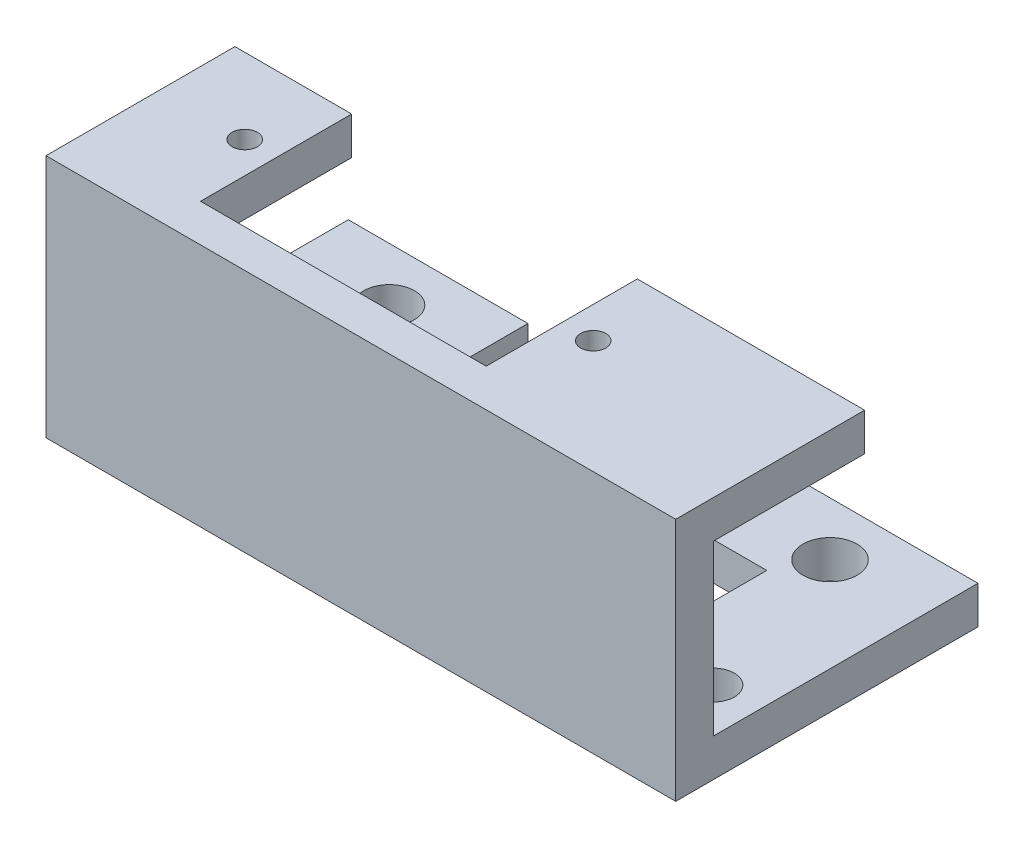
ISO-10303-21;
HEADER;
FILE_DESCRIPTION(('STEP AP214'),'2;1');
FILE_NAME('part.step','',(''),(''),'','','');
FILE_SCHEMA(('AUTOMOTIVE_DESIGN { 1 0 10303 214 1 1 1 1 }'));
ENDSEC;
DATA;
#1=APPLICATION_CONTEXT('core data for automotive mechanical design processes');
#2=APPLICATION_PROTOCOL_DEFINITION('international standard','automotive_design',2000,#1);
#3=PRODUCT_CONTEXT('',#1,'mechanical');
#4=PRODUCT('Part','Part','',(#3));
#5=PRODUCT_RELATED_PRODUCT_CATEGORY('part','',(#4));
#6=PRODUCT_DEFINITION_FORMATION('','',#4);
#7=PRODUCT_DEFINITION_CONTEXT('part definition',#1,'design');
#8=PRODUCT_DEFINITION('design','',#6,#7);
#9=PRODUCT_DEFINITION_SHAPE('','',#8);
#10=(LENGTH_UNIT() NAMED_UNIT(*) SI_UNIT(.MILLI.,.METRE.));
#11=(NAMED_UNIT(*) PLANE_ANGLE_UNIT() SI_UNIT($,.RADIAN.));
#12=(NAMED_UNIT(*) SI_UNIT($,.STERADIAN.) SOLID_ANGLE_UNIT());
#13=UNCERTAINTY_MEASURE_WITH_UNIT(LENGTH_MEASURE(1.E-05),#10,'distance_accuracy_value','');
#14=(GEOMETRIC_REPRESENTATION_CONTEXT(3) GLOBAL_UNCERTAINTY_ASSIGNED_CONTEXT((#13)) GLOBAL_UNIT_ASSIGNED_CONTEXT((#10,
#11,#12)) REPRESENTATION_CONTEXT('',''));
#15=CARTESIAN_POINT('',(0.,0.,0.));
#16=DIRECTION('',(0.,0.,1.));
#17=DIRECTION('',(1.,0.,0.));
#18=AXIS2_PLACEMENT_3D('',#15,#16,#17);
#19=CARTESIAN_POINT('',(40.73,0.,-21.));
#20=DIRECTION('',(1.,0.,0.));
#21=DIRECTION('',(0.,0.,-1.));
#22=AXIS2_PLACEMENT_3D('',#19,#20,#21);
#23=PLANE('',#22);
#24=DIRECTION('',(0.,1.,0.));
#25=VECTOR('',#24,1.);
#26=CARTESIAN_POINT('',(40.73,2.99667999749431,-13.5));
#27=LINE('',#26,#25);
#28=CARTESIAN_POINT('',(40.73,0.,-13.5));
#29=VERTEX_POINT('',#28);
#30=CARTESIAN_POINT('',(40.73,2.99667999749431,-13.5));
#31=VERTEX_POINT('',#30);
#32=EDGE_CURVE('E200',#29,#31,#27,.T.);
#33=ORIENTED_EDGE('',*,*,#32,.F.);
#34=DIRECTION('',(0.,0.,1.));
#35=VECTOR('',#34,1.);
#36=CARTESIAN_POINT('',(40.73,0.,-21.));
#37=LINE('',#36,#35);
#38=CARTESIAN_POINT('',(40.73,0.,0.));
#39=VERTEX_POINT('',#38);
#40=EDGE_CURVE('E260',#29,#39,#37,.T.);
#41=ORIENTED_EDGE('',*,*,#40,.T.);
#42=DIRECTION('',(0.,1.,0.));
#43=VECTOR('',#42,1.);
#44=CARTESIAN_POINT('',(40.73,0.,0.));
#45=LINE('',#44,#43);
#46=CARTESIAN_POINT('',(40.73,2.99667999749431,0.));
#47=VERTEX_POINT('',#46);
#48=EDGE_CURVE('E243',#39,#47,#45,.T.);
#49=ORIENTED_EDGE('',*,*,#48,.T.);
#50=DIRECTION('',(0.,0.,1.));
#51=VECTOR('',#50,1.);
#52=CARTESIAN_POINT('',(40.73,2.99667999749431,-21.));
#53=LINE('',#52,#51);
#54=EDGE_CURVE('E258',#31,#47,#53,.T.);
#55=ORIENTED_EDGE('',*,*,#54,.F.);
#56=EDGE_LOOP('',(#33,#41,#49,#55));
#57=FACE_BOUND('',#56,.T.);
#58=ADVANCED_FACE('F37',(#57),#23,.F.);
#59=CARTESIAN_POINT('',(9.27,0.,-21.));
#60=DIRECTION('',(1.,0.,0.));
#61=DIRECTION('',(0.,0.,-1.));
#62=AXIS2_PLACEMENT_3D('',#59,#60,#61);
#63=PLANE('',#62);
#64=DIRECTION('',(0.,0.,1.));
#65=VECTOR('',#64,1.);
#66=CARTESIAN_POINT('',(9.27,0.,-21.));
#67=LINE('',#66,#65);
#68=CARTESIAN_POINT('',(9.27,0.,-13.5));
#69=VERTEX_POINT('',#68);
#70=CARTESIAN_POINT('',(9.27,0.,0.));
#71=VERTEX_POINT('',#70);
#72=EDGE_CURVE('E59',#69,#71,#67,.T.);
#73=ORIENTED_EDGE('',*,*,#72,.F.);
#74=DIRECTION('',(0.,-1.,0.));
#75=VECTOR('',#74,1.);
#76=CARTESIAN_POINT('',(9.27,2.99667999749431,-13.5));
#77=LINE('',#76,#75);
#78=CARTESIAN_POINT('',(9.27,2.99667999749431,-13.5));
#79=VERTEX_POINT('',#78);
#80=EDGE_CURVE('E54',#79,#69,#77,.T.);
#81=ORIENTED_EDGE('',*,*,#80,.F.);
#82=DIRECTION('',(0.,0.,1.));
#83=VECTOR('',#82,1.);
#84=CARTESIAN_POINT('',(9.27,2.99667999749431,-21.));
#85=LINE('',#84,#83);
#86=CARTESIAN_POINT('',(9.27,2.99667999749431,0.));
#87=VERTEX_POINT('',#86);
#88=EDGE_CURVE('E232',#79,#87,#85,.T.);
#89=ORIENTED_EDGE('',*,*,#88,.T.);
#90=DIRECTION('',(0.,1.,0.));
#91=VECTOR('',#90,1.);
#92=CARTESIAN_POINT('',(9.27,0.,0.));
#93=LINE('',#92,#91);
#94=EDGE_CURVE('E236',#71,#87,#93,.T.);
#95=ORIENTED_EDGE('',*,*,#94,.F.);
#96=EDGE_LOOP('',(#73,#81,#89,#95));
#97=FACE_BOUND('',#96,.T.);
#98=ADVANCED_FACE('F363',(#97),#63,.T.);
#99=CARTESIAN_POINT('',(0.,0.,0.));
#100=DIRECTION('',(0.,0.,-1.));
#101=DIRECTION('',(-1.,0.,0.));
#102=AXIS2_PLACEMENT_3D('',#99,#100,#101);
#103=PLANE('',#102);
#104=ORIENTED_EDGE('',*,*,#94,.T.);
#105=DIRECTION('',(1.,0.,0.));
#106=VECTOR('',#105,1.);
#107=CARTESIAN_POINT('',(0.,2.99667999749431,0.));
#108=LINE('',#107,#106);
#109=CARTESIAN_POINT('',(0.,2.99667999749431,0.));
#110=VERTEX_POINT('',#109);
#111=EDGE_CURVE('E239',#110,#87,#108,.T.);
#112=ORIENTED_EDGE('',*,*,#111,.F.);
#113=DIRECTION('',(0.,-1.,0.));
#114=VECTOR('',#113,1.);
#115=CARTESIAN_POINT('',(0.,0.,0.));
#116=LINE('',#115,#114);
#117=CARTESIAN_POINT('',(0.,16.4,0.));
#118=VERTEX_POINT('',#117);
#119=EDGE_CURVE('E314',#118,#110,#116,.T.);
#120=ORIENTED_EDGE('',*,*,#119,.F.);
#121=DIRECTION('',(1.,0.,0.));
#122=VECTOR('',#121,1.);
#123=CARTESIAN_POINT('',(0.,16.4,0.));
#124=LINE('',#123,#122);
#125=CARTESIAN_POINT('',(9.27,16.4,0.));
#126=VERTEX_POINT('',#125);
#127=EDGE_CURVE('E279',#118,#126,#124,.T.);
#128=ORIENTED_EDGE('',*,*,#127,.T.);
#129=DIRECTION('',(0.,-1.,0.));
#130=VECTOR('',#129,1.);
#131=CARTESIAN_POINT('',(9.27,19.4,0.));
#132=LINE('',#131,#130);
#133=CARTESIAN_POINT('',(9.27,19.4,0.));
#134=VERTEX_POINT('',#133);
#135=EDGE_CURVE('E276',#134,#126,#132,.T.);
#136=ORIENTED_EDGE('',*,*,#135,.F.);
#137=DIRECTION('',(-1.,0.,0.));
#138=VECTOR('',#137,1.);
#139=CARTESIAN_POINT('',(0.,19.4,0.));
#140=LINE('',#139,#138);
#141=CARTESIAN_POINT('',(31.95,19.4,0.));
#142=VERTEX_POINT('',#141);
#143=EDGE_CURVE('E319',#142,#134,#140,.T.);
#144=ORIENTED_EDGE('',*,*,#143,.F.);
#145=DIRECTION('',(0.,-1.,0.));
#146=VECTOR('',#145,1.);
#147=CARTESIAN_POINT('',(31.95,19.4,0.));
#148=LINE('',#147,#146);
#149=CARTESIAN_POINT('',(31.95,16.4,0.));
#150=VERTEX_POINT('',#149);
#151=EDGE_CURVE('E295',#142,#150,#148,.T.);
#152=ORIENTED_EDGE('',*,*,#151,.T.);
#153=DIRECTION('',(-1.,0.,0.));
#154=VECTOR('',#153,1.);
#155=CARTESIAN_POINT('',(50.,16.4,0.));
#156=LINE('',#155,#154);
#157=CARTESIAN_POINT('',(50.,16.4,0.));
#158=VERTEX_POINT('',#157);
#159=EDGE_CURVE('E283',#158,#150,#156,.T.);
#160=ORIENTED_EDGE('',*,*,#159,.F.);
#161=DIRECTION('',(0.,1.,0.));
#162=VECTOR('',#161,1.);
#163=CARTESIAN_POINT('',(50.,0.,0.));
#164=LINE('',#163,#162);
#165=CARTESIAN_POINT('',(50.,2.99667999749431,0.));
#166=VERTEX_POINT('',#165);
#167=EDGE_CURVE('E331',#166,#158,#164,.T.);
#168=ORIENTED_EDGE('',*,*,#167,.F.);
#169=DIRECTION('',(-1.,0.,0.));
#170=VECTOR('',#169,1.);
#171=CARTESIAN_POINT('',(0.,2.99667999749431,0.));
#172=LINE('',#171,#170);
#173=EDGE_CURVE('E185',#166,#47,#172,.T.);
#174=ORIENTED_EDGE('',*,*,#173,.T.);
#175=ORIENTED_EDGE('',*,*,#48,.F.);
#176=DIRECTION('',(1.,0.,0.));
#177=VECTOR('',#176,1.);
#178=CARTESIAN_POINT('',(0.,0.,0.));
#179=LINE('',#178,#177);
#180=EDGE_CURVE('E328',#71,#39,#179,.T.);
#181=ORIENTED_EDGE('',*,*,#180,.F.);
#182=EDGE_LOOP('',(#104,#112,#120,#128,#136,#144,#152,#160,#168,#174,#175,#181));
#183=FACE_BOUND('',#182,.T.);
#184=ADVANCED_FACE('F368',(#183),#103,.T.);
#185=CARTESIAN_POINT('',(0.,0.,3.));
#186=DIRECTION('',(1.,0.,0.));
#187=DIRECTION('',(0.,0.,-1.));
#188=AXIS2_PLACEMENT_3D('',#185,#186,#187);
#189=PLANE('',#188);
#190=DIRECTION('',(0.,0.,-1.));
#191=VECTOR('',#190,1.);
#192=CARTESIAN_POINT('',(0.,19.4,3.));
#193=LINE('',#192,#191);
#194=CARTESIAN_POINT('',(0.,19.4,3.));
#195=VERTEX_POINT('',#194);
#196=CARTESIAN_POINT('',(0.,19.4,-12.));
#197=VERTEX_POINT('',#196);
#198=EDGE_CURVE('E325',#195,#197,#193,.T.);
#199=ORIENTED_EDGE('',*,*,#198,.T.);
#200=DIRECTION('',(0.,-1.,0.));
#201=VECTOR('',#200,1.);
#202=CARTESIAN_POINT('',(0.,19.4,-12.));
#203=LINE('',#202,#201);
#204=CARTESIAN_POINT('',(0.,16.4,-12.));
#205=VERTEX_POINT('',#204);
#206=EDGE_CURVE('E271',#197,#205,#203,.T.);
#207=ORIENTED_EDGE('',*,*,#206,.T.);
#208=DIRECTION('',(0.,0.,1.));
#209=VECTOR('',#208,1.);
#210=CARTESIAN_POINT('',(0.,16.4,-12.));
#211=LINE('',#210,#209);
#212=EDGE_CURVE('E274',#205,#118,#211,.T.);
#213=ORIENTED_EDGE('',*,*,#212,.T.);
#214=ORIENTED_EDGE('',*,*,#119,.T.);
#215=DIRECTION('',(0.,0.,1.));
#216=VECTOR('',#215,1.);
#217=CARTESIAN_POINT('',(0.,2.99667999749431,-21.));
#218=LINE('',#217,#216);
#219=CARTESIAN_POINT('',(0.,2.99667999749431,-21.));
#220=VERTEX_POINT('',#219);
#221=EDGE_CURVE('E230',#220,#110,#218,.T.);
#222=ORIENTED_EDGE('',*,*,#221,.F.);
#223=DIRECTION('',(0.,1.,0.));
#224=VECTOR('',#223,1.);
#225=CARTESIAN_POINT('',(0.,0.,-21.));
#226=LINE('',#225,#224);
#227=CARTESIAN_POINT('',(0.,0.,-21.));
#228=VERTEX_POINT('',#227);
#229=EDGE_CURVE('E240',#228,#220,#226,.T.);
#230=ORIENTED_EDGE('',*,*,#229,.F.);
#231=DIRECTION('',(0.,0.,-1.));
#232=VECTOR('',#231,1.);
#233=CARTESIAN_POINT('',(0.,0.,3.));
#234=LINE('',#233,#232);
#235=CARTESIAN_POINT('',(0.,0.,3.));
#236=VERTEX_POINT('',#235);
#237=EDGE_CURVE('E11',#236,#228,#234,.T.);
#238=ORIENTED_EDGE('',*,*,#237,.F.);
#239=DIRECTION('',(0.,-1.,0.));
#240=VECTOR('',#239,1.);
#241=CARTESIAN_POINT('',(0.,0.,3.));
#242=LINE('',#241,#240);
#243=EDGE_CURVE('E315',#195,#236,#242,.T.);
#244=ORIENTED_EDGE('',*,*,#243,.F.);
#245=EDGE_LOOP('',(#199,#207,#213,#214,#222,#230,#238,#244));
#246=FACE_BOUND('',#245,.T.);
#247=ADVANCED_FACE('F39',(#246),#189,.F.);
#248=CARTESIAN_POINT('',(0.,0.,3.));
#249=DIRECTION('',(0.,1.,0.));
#250=DIRECTION('',(0.,0.,1.));
#251=AXIS2_PLACEMENT_3D('',#248,#249,#250);
#252=PLANE('',#251);
#253=CARTESIAN_POINT('',(3.5,0.,-3.5));
#254=DIRECTION('',(0.,1.,0.));
#255=DIRECTION('',(0.,0.,1.));
#256=AXIS2_PLACEMENT_3D('',#253,#254,#255);
#257=CIRCLE('',#256,1.65);
#258=CARTESIAN_POINT('',(3.5,0.,-1.85));
#259=VERTEX_POINT('',#258);
#260=EDGE_CURVE('E419',#259,#259,#257,.T.);
#261=ORIENTED_EDGE('',*,*,#260,.T.);
#262=EDGE_LOOP('',(#261));
#263=FACE_BOUND('',#262,.T.);
#264=CARTESIAN_POINT('',(7.5,0.,-16.75));
#265=DIRECTION('',(0.,1.,0.));
#266=DIRECTION('',(0.,0.,1.));
#267=AXIS2_PLACEMENT_3D('',#264,#265,#266);
#268=CIRCLE('',#267,2.);
#269=CARTESIAN_POINT('',(7.5,0.,-14.75));
#270=VERTEX_POINT('',#269);
#271=EDGE_CURVE('E422',#270,#270,#268,.T.);
#272=ORIENTED_EDGE('',*,*,#271,.T.);
#273=EDGE_LOOP('',(#272));
#274=FACE_BOUND('',#273,.T.);
#275=CARTESIAN_POINT('',(46.5,0.,-3.5));
#276=DIRECTION('',(0.,1.,0.));
#277=DIRECTION('',(0.,0.,1.));
#278=AXIS2_PLACEMENT_3D('',#275,#276,#277);
#279=CIRCLE('',#278,1.65);
#280=CARTESIAN_POINT('',(46.5,0.,-1.85));
#281=VERTEX_POINT('',#280);
#282=EDGE_CURVE('E202',#281,#281,#279,.T.);
#283=ORIENTED_EDGE('',*,*,#282,.T.);
#284=EDGE_LOOP('',(#283));
#285=FACE_BOUND('',#284,.T.);
#286=CARTESIAN_POINT('',(42.5,0.,-16.75));
#287=DIRECTION('',(0.,1.,0.));
#288=DIRECTION('',(0.,0.,1.));
#289=AXIS2_PLACEMENT_3D('',#286,#287,#288);
#290=CIRCLE('',#289,2.15);
#291=CARTESIAN_POINT('',(42.5,0.,-14.6));
#292=VERTEX_POINT('',#291);
#293=EDGE_CURVE('E432',#292,#292,#290,.T.);
#294=ORIENTED_EDGE('',*,*,#293,.T.);
#295=EDGE_LOOP('',(#294));
#296=FACE_BOUND('',#295,.T.);
#297=ORIENTED_EDGE('',*,*,#237,.T.);
#298=DIRECTION('',(1.,0.,0.));
#299=VECTOR('',#298,1.);
#300=CARTESIAN_POINT('',(0.,0.,-21.));
#301=LINE('',#300,#299);
#302=CARTESIAN_POINT('',(14.27,0.,-21.));
#303=VERTEX_POINT('',#302);
#304=EDGE_CURVE('E235',#228,#303,#301,.T.);
#305=ORIENTED_EDGE('',*,*,#304,.T.);
#306=DIRECTION('',(0.,0.,-1.));
#307=VECTOR('',#306,1.);
#308=CARTESIAN_POINT('',(14.27,0.,-21.));
#309=LINE('',#308,#307);
#310=CARTESIAN_POINT('',(14.27,0.,-13.5));
#311=VERTEX_POINT('',#310);
#312=EDGE_CURVE('E220',#311,#303,#309,.T.);
#313=ORIENTED_EDGE('',*,*,#312,.F.);
#314=DIRECTION('',(-1.,0.,0.));
#315=VECTOR('',#314,1.);
#316=CARTESIAN_POINT('',(14.27,0.,-13.5));
#317=LINE('',#316,#315);
#318=EDGE_CURVE('E223',#311,#69,#317,.T.);
#319=ORIENTED_EDGE('',*,*,#318,.T.);
#320=ORIENTED_EDGE('',*,*,#72,.T.);
#321=ORIENTED_EDGE('',*,*,#180,.T.);
#322=ORIENTED_EDGE('',*,*,#40,.F.);
#323=DIRECTION('',(1.,0.,0.));
#324=VECTOR('',#323,1.);
#325=CARTESIAN_POINT('',(35.73,0.,-13.5));
#326=LINE('',#325,#324);
#327=CARTESIAN_POINT('',(35.73,0.,-13.5));
#328=VERTEX_POINT('',#327);
#329=EDGE_CURVE('E191',#328,#29,#326,.T.);
#330=ORIENTED_EDGE('',*,*,#329,.F.);
#331=DIRECTION('',(0.,0.,1.));
#332=VECTOR('',#331,1.);
#333=CARTESIAN_POINT('',(35.73,0.,-21.));
#334=LINE('',#333,#332);
#335=CARTESIAN_POINT('',(35.73,0.,-21.));
#336=VERTEX_POINT('',#335);
#337=EDGE_CURVE('E188',#336,#328,#334,.T.);
#338=ORIENTED_EDGE('',*,*,#337,.F.);
#339=DIRECTION('',(-1.,0.,0.));
#340=VECTOR('',#339,1.);
#341=CARTESIAN_POINT('',(0.,0.,-21.));
#342=LINE('',#341,#340);
#343=CARTESIAN_POINT('',(50.,0.,-21.));
#344=VERTEX_POINT('',#343);
#345=EDGE_CURVE('E174',#344,#336,#342,.T.);
#346=ORIENTED_EDGE('',*,*,#345,.F.);
#347=DIRECTION('',(0.,0.,-1.));
#348=VECTOR('',#347,1.);
#349=CARTESIAN_POINT('',(50.,0.,3.));
#350=LINE('',#349,#348);
#351=CARTESIAN_POINT('',(50.,0.,3.));
#352=VERTEX_POINT('',#351);
#353=EDGE_CURVE('E46',#352,#344,#350,.T.);
#354=ORIENTED_EDGE('',*,*,#353,.F.);
#355=DIRECTION('',(1.,0.,0.));
#356=VECTOR('',#355,1.);
#357=CARTESIAN_POINT('',(0.,0.,3.));
#358=LINE('',#357,#356);
#359=EDGE_CURVE('E318',#236,#352,#358,.T.);
#360=ORIENTED_EDGE('',*,*,#359,.F.);
#361=EDGE_LOOP('',(#297,#305,#313,#319,#320,#321,#322,#330,#338,#346,#354,#360));
#362=FACE_BOUND('',#361,.T.);
#363=ADVANCED_FACE('F189',(#263,#274,#285,#296,#362),#252,.F.);
#364=CARTESIAN_POINT('',(50.,0.,3.));
#365=DIRECTION('',(-1.,0.,0.));
#366=DIRECTION('',(0.,0.,1.));
#367=AXIS2_PLACEMENT_3D('',#364,#365,#366);
#368=PLANE('',#367);
#369=ORIENTED_EDGE('',*,*,#353,.T.);
#370=DIRECTION('',(0.,-1.,0.));
#371=VECTOR('',#370,1.);
#372=CARTESIAN_POINT('',(50.,0.,-21.));
#373=LINE('',#372,#371);
#374=CARTESIAN_POINT('',(50.,2.99667999749431,-21.));
#375=VERTEX_POINT('',#374);
#376=EDGE_CURVE('E181',#375,#344,#373,.T.);
#377=ORIENTED_EDGE('',*,*,#376,.F.);
#378=DIRECTION('',(0.,0.,1.));
#379=VECTOR('',#378,1.);
#380=CARTESIAN_POINT('',(50.,2.99667999749431,-21.));
#381=LINE('',#380,#379);
#382=EDGE_CURVE('E251',#375,#166,#381,.T.);
#383=ORIENTED_EDGE('',*,*,#382,.T.);
#384=ORIENTED_EDGE('',*,*,#167,.T.);
#385=DIRECTION('',(0.,0.,1.));
#386=VECTOR('',#385,1.);
#387=CARTESIAN_POINT('',(50.,16.4,-12.));
#388=LINE('',#387,#386);
#389=CARTESIAN_POINT('',(50.,16.4,-12.));
#390=VERTEX_POINT('',#389);
#391=EDGE_CURVE('E303',#390,#158,#388,.T.);
#392=ORIENTED_EDGE('',*,*,#391,.F.);
#393=DIRECTION('',(0.,-1.,0.));
#394=VECTOR('',#393,1.);
#395=CARTESIAN_POINT('',(50.,19.4,-12.));
#396=LINE('',#395,#394);
#397=CARTESIAN_POINT('',(50.,19.4,-12.));
#398=VERTEX_POINT('',#397);
#399=EDGE_CURVE('E301',#398,#390,#396,.T.);
#400=ORIENTED_EDGE('',*,*,#399,.F.);
#401=DIRECTION('',(0.,0.,-1.));
#402=VECTOR('',#401,1.);
#403=CARTESIAN_POINT('',(50.,19.4,3.));
#404=LINE('',#403,#402);
#405=CARTESIAN_POINT('',(50.,19.4,3.));
#406=VERTEX_POINT('',#405);
#407=EDGE_CURVE('E336',#406,#398,#404,.T.);
#408=ORIENTED_EDGE('',*,*,#407,.F.);
#409=DIRECTION('',(0.,1.,0.));
#410=VECTOR('',#409,1.);
#411=CARTESIAN_POINT('',(50.,0.,3.));
#412=LINE('',#411,#410);
#413=EDGE_CURVE('E321',#352,#406,#412,.T.);
#414=ORIENTED_EDGE('',*,*,#413,.F.);
#415=EDGE_LOOP('',(#369,#377,#383,#384,#392,#400,#408,#414));
#416=FACE_BOUND('',#415,.T.);
#417=ADVANCED_FACE('F441',(#416),#368,.F.);
#418=CARTESIAN_POINT('',(0.,19.4,3.));
#419=DIRECTION('',(0.,-1.,0.));
#420=DIRECTION('',(0.,0.,-1.));
#421=AXIS2_PLACEMENT_3D('',#418,#419,#420);
#422=PLANE('',#421);
#423=CARTESIAN_POINT('',(34.45,19.4,-6.));
#424=DIRECTION('',(0.,1.,0.));
#425=DIRECTION('',(0.,0.,1.));
#426=AXIS2_PLACEMENT_3D('',#423,#424,#425);
#427=CIRCLE('',#426,0.999999999999998);
#428=CARTESIAN_POINT('',(34.45,19.4,-5.));
#429=VERTEX_POINT('',#428);
#430=EDGE_CURVE('E263',#429,#429,#427,.T.);
#431=ORIENTED_EDGE('',*,*,#430,.F.);
#432=EDGE_LOOP('',(#431));
#433=FACE_BOUND('',#432,.T.);
#434=CARTESIAN_POINT('',(6.78,19.4,-6.));
#435=DIRECTION('',(0.,1.,0.));
#436=DIRECTION('',(0.,0.,1.));
#437=AXIS2_PLACEMENT_3D('',#434,#435,#436);
#438=CIRCLE('',#437,1.);
#439=CARTESIAN_POINT('',(6.78,19.4,-5.));
#440=VERTEX_POINT('',#439);
#441=EDGE_CURVE('E262',#440,#440,#438,.T.);
#442=ORIENTED_EDGE('',*,*,#441,.F.);
#443=EDGE_LOOP('',(#442));
#444=FACE_BOUND('',#443,.T.);
#445=ORIENTED_EDGE('',*,*,#407,.T.);
#446=DIRECTION('',(-1.,0.,0.));
#447=VECTOR('',#446,1.);
#448=CARTESIAN_POINT('',(50.,19.4,-12.));
#449=LINE('',#448,#447);
#450=CARTESIAN_POINT('',(31.95,19.4,-12.));
#451=VERTEX_POINT('',#450);
#452=EDGE_CURVE('E298',#398,#451,#449,.T.);
#453=ORIENTED_EDGE('',*,*,#452,.T.);
#454=DIRECTION('',(0.,0.,1.));
#455=VECTOR('',#454,1.);
#456=CARTESIAN_POINT('',(31.95,19.4,-12.));
#457=LINE('',#456,#455);
#458=EDGE_CURVE('E309',#451,#142,#457,.T.);
#459=ORIENTED_EDGE('',*,*,#458,.T.);
#460=ORIENTED_EDGE('',*,*,#143,.T.);
#461=DIRECTION('',(0.,0.,1.));
#462=VECTOR('',#461,1.);
#463=CARTESIAN_POINT('',(9.27,19.4,-12.));
#464=LINE('',#463,#462);
#465=CARTESIAN_POINT('',(9.27,19.4,-12.));
#466=VERTEX_POINT('',#465);
#467=EDGE_CURVE('E272',#466,#134,#464,.T.);
#468=ORIENTED_EDGE('',*,*,#467,.F.);
#469=DIRECTION('',(1.,0.,0.));
#470=VECTOR('',#469,1.);
#471=CARTESIAN_POINT('',(0.,19.4,-12.));
#472=LINE('',#471,#470);
#473=EDGE_CURVE('E286',#197,#466,#472,.T.);
#474=ORIENTED_EDGE('',*,*,#473,.F.);
#475=ORIENTED_EDGE('',*,*,#198,.F.);
#476=DIRECTION('',(-1.,0.,0.));
#477=VECTOR('',#476,1.);
#478=CARTESIAN_POINT('',(0.,19.4,3.));
#479=LINE('',#478,#477);
#480=EDGE_CURVE('E323',#406,#195,#479,.T.);
#481=ORIENTED_EDGE('',*,*,#480,.F.);
#482=EDGE_LOOP('',(#445,#453,#459,#460,#468,#474,#475,#481));
#483=FACE_BOUND('',#482,.T.);
#484=ADVANCED_FACE('F446',(#433,#444,#483),#422,.F.);
#485=CARTESIAN_POINT('',(0.,0.,3.));
#486=DIRECTION('',(0.,0.,-1.));
#487=DIRECTION('',(-1.,0.,0.));
#488=AXIS2_PLACEMENT_3D('',#485,#486,#487);
#489=PLANE('',#488);
#490=ORIENTED_EDGE('',*,*,#243,.T.);
#491=ORIENTED_EDGE('',*,*,#359,.T.);
#492=ORIENTED_EDGE('',*,*,#413,.T.);
#493=ORIENTED_EDGE('',*,*,#480,.T.);
#494=EDGE_LOOP('',(#490,#491,#492,#493));
#495=FACE_BOUND('',#494,.T.);
#496=ADVANCED_FACE('F454',(#495),#489,.F.);
#497=CARTESIAN_POINT('',(50.,16.4,-12.));
#498=DIRECTION('',(0.,1.,0.));
#499=DIRECTION('',(0.,0.,1.));
#500=AXIS2_PLACEMENT_3D('',#497,#498,#499);
#501=PLANE('',#500);
#502=CARTESIAN_POINT('',(34.45,16.4,-6.));
#503=DIRECTION('',(0.,1.,0.));
#504=DIRECTION('',(0.,0.,1.));
#505=AXIS2_PLACEMENT_3D('',#502,#503,#504);
#506=CIRCLE('',#505,0.999999999999998);
#507=CARTESIAN_POINT('',(34.45,16.4,-5.));
#508=VERTEX_POINT('',#507);
#509=EDGE_CURVE('E41',#508,#508,#506,.T.);
#510=ORIENTED_EDGE('',*,*,#509,.T.);
#511=EDGE_LOOP('',(#510));
#512=FACE_BOUND('',#511,.T.);
#513=ORIENTED_EDGE('',*,*,#159,.T.);
#514=DIRECTION('',(0.,0.,1.));
#515=VECTOR('',#514,1.);
#516=CARTESIAN_POINT('',(31.95,16.4,-12.));
#517=LINE('',#516,#515);
#518=CARTESIAN_POINT('',(31.95,16.4,-12.));
#519=VERTEX_POINT('',#518);
#520=EDGE_CURVE('E311',#519,#150,#517,.T.);
#521=ORIENTED_EDGE('',*,*,#520,.F.);
#522=DIRECTION('',(-1.,0.,0.));
#523=VECTOR('',#522,1.);
#524=CARTESIAN_POINT('',(50.,16.4,-12.));
#525=LINE('',#524,#523);
#526=EDGE_CURVE('E292',#390,#519,#525,.T.);
#527=ORIENTED_EDGE('',*,*,#526,.F.);
#528=ORIENTED_EDGE('',*,*,#391,.T.);
#529=EDGE_LOOP('',(#513,#521,#527,#528));
#530=FACE_BOUND('',#529,.T.);
#531=ADVANCED_FACE('F344',(#512,#530),#501,.F.);
#532=CARTESIAN_POINT('',(31.95,19.4,-12.));
#533=DIRECTION('',(-1.,0.,0.));
#534=DIRECTION('',(0.,0.,1.));
#535=AXIS2_PLACEMENT_3D('',#532,#533,#534);
#536=PLANE('',#535);
#537=ORIENTED_EDGE('',*,*,#151,.F.);
#538=ORIENTED_EDGE('',*,*,#458,.F.);
#539=DIRECTION('',(0.,-1.,0.));
#540=VECTOR('',#539,1.);
#541=CARTESIAN_POINT('',(31.95,19.4,-12.));
#542=LINE('',#541,#540);
#543=EDGE_CURVE('E294',#451,#519,#542,.T.);
#544=ORIENTED_EDGE('',*,*,#543,.T.);
#545=ORIENTED_EDGE('',*,*,#520,.T.);
#546=EDGE_LOOP('',(#537,#538,#544,#545));
#547=FACE_BOUND('',#546,.T.);
#548=ADVANCED_FACE('F464',(#547),#536,.T.);
#549=CARTESIAN_POINT('',(0.,0.,-12.));
#550=DIRECTION('',(0.,0.,1.));
#551=DIRECTION('',(1.,0.,0.));
#552=AXIS2_PLACEMENT_3D('',#549,#550,#551);
#553=PLANE('',#552);
#554=ORIENTED_EDGE('',*,*,#526,.T.);
#555=ORIENTED_EDGE('',*,*,#543,.F.);
#556=ORIENTED_EDGE('',*,*,#452,.F.);
#557=ORIENTED_EDGE('',*,*,#399,.T.);
#558=EDGE_LOOP('',(#554,#555,#556,#557));
#559=FACE_BOUND('',#558,.T.);
#560=ADVANCED_FACE('F467',(#559),#553,.F.);
#561=CARTESIAN_POINT('',(0.,16.4,-12.));
#562=DIRECTION('',(0.,-1.,0.));
#563=DIRECTION('',(0.,0.,-1.));
#564=AXIS2_PLACEMENT_3D('',#561,#562,#563);
#565=PLANE('',#564);
#566=CARTESIAN_POINT('',(6.78,16.4,-6.));
#567=DIRECTION('',(0.,-1.,0.));
#568=DIRECTION('',(0.,0.,-1.));
#569=AXIS2_PLACEMENT_3D('',#566,#567,#568);
#570=CIRCLE('',#569,1.);
#571=CARTESIAN_POINT('',(6.78,16.4,-7.));
#572=VERTEX_POINT('',#571);
#573=EDGE_CURVE('E266',#572,#572,#570,.T.);
#574=ORIENTED_EDGE('',*,*,#573,.F.);
#575=EDGE_LOOP('',(#574));
#576=FACE_BOUND('',#575,.T.);
#577=ORIENTED_EDGE('',*,*,#127,.F.);
#578=ORIENTED_EDGE('',*,*,#212,.F.);
#579=DIRECTION('',(1.,0.,0.));
#580=VECTOR('',#579,1.);
#581=CARTESIAN_POINT('',(0.,16.4,-12.));
#582=LINE('',#581,#580);
#583=CARTESIAN_POINT('',(9.27,16.4,-12.));
#584=VERTEX_POINT('',#583);
#585=EDGE_CURVE('E280',#205,#584,#582,.T.);
#586=ORIENTED_EDGE('',*,*,#585,.T.);
#587=DIRECTION('',(0.,0.,1.));
#588=VECTOR('',#587,1.);
#589=CARTESIAN_POINT('',(9.27,16.4,-12.));
#590=LINE('',#589,#588);
#591=EDGE_CURVE('E269',#584,#126,#590,.T.);
#592=ORIENTED_EDGE('',*,*,#591,.T.);
#593=EDGE_LOOP('',(#577,#578,#586,#592));
#594=FACE_BOUND('',#593,.T.);
#595=ADVANCED_FACE('F471',(#576,#594),#565,.T.);
#596=CARTESIAN_POINT('',(9.27,19.4,-12.));
#597=DIRECTION('',(-1.,0.,0.));
#598=DIRECTION('',(0.,0.,1.));
#599=AXIS2_PLACEMENT_3D('',#596,#597,#598);
#600=PLANE('',#599);
#601=ORIENTED_EDGE('',*,*,#135,.T.);
#602=ORIENTED_EDGE('',*,*,#591,.F.);
#603=DIRECTION('',(0.,-1.,0.));
#604=VECTOR('',#603,1.);
#605=CARTESIAN_POINT('',(9.27,19.4,-12.));
#606=LINE('',#605,#604);
#607=EDGE_CURVE('E288',#466,#584,#606,.T.);
#608=ORIENTED_EDGE('',*,*,#607,.F.);
#609=ORIENTED_EDGE('',*,*,#467,.T.);
#610=EDGE_LOOP('',(#601,#602,#608,#609));
#611=FACE_BOUND('',#610,.T.);
#612=ADVANCED_FACE('F475',(#611),#600,.F.);
#613=CARTESIAN_POINT('',(0.,0.,-12.));
#614=DIRECTION('',(0.,0.,-1.));
#615=DIRECTION('',(-1.,0.,0.));
#616=AXIS2_PLACEMENT_3D('',#613,#614,#615);
#617=PLANE('',#616);
#618=ORIENTED_EDGE('',*,*,#585,.F.);
#619=ORIENTED_EDGE('',*,*,#206,.F.);
#620=ORIENTED_EDGE('',*,*,#473,.T.);
#621=ORIENTED_EDGE('',*,*,#607,.T.);
#622=EDGE_LOOP('',(#618,#619,#620,#621));
#623=FACE_BOUND('',#622,.T.);
#624=ADVANCED_FACE('F359',(#623),#617,.T.);
#625=CARTESIAN_POINT('',(6.78,15.4,-6.));
#626=DIRECTION('',(0.,1.,0.));
#627=DIRECTION('',(0.,0.,1.));
#628=AXIS2_PLACEMENT_3D('',#625,#626,#627);
#629=CYLINDRICAL_SURFACE('',#628,1.);
#630=ORIENTED_EDGE('',*,*,#573,.T.);
#631=EDGE_LOOP('',(#630));
#632=FACE_BOUND('',#631,.T.);
#633=ORIENTED_EDGE('',*,*,#441,.T.);
#634=EDGE_LOOP('',(#633));
#635=FACE_BOUND('',#634,.T.);
#636=ADVANCED_FACE('F350',(#632,#635),#629,.F.);
#637=CARTESIAN_POINT('',(34.45,15.4,-6.));
#638=DIRECTION('',(0.,1.,0.));
#639=DIRECTION('',(0.,0.,1.));
#640=AXIS2_PLACEMENT_3D('',#637,#638,#639);
#641=CYLINDRICAL_SURFACE('',#640,0.999999999999998);
#642=ORIENTED_EDGE('',*,*,#430,.T.);
#643=EDGE_LOOP('',(#642));
#644=FACE_BOUND('',#643,.T.);
#645=ORIENTED_EDGE('',*,*,#509,.F.);
#646=EDGE_LOOP('',(#645));
#647=FACE_BOUND('',#646,.T.);
#648=ADVANCED_FACE('F347',(#644,#647),#641,.F.);
#649=CARTESIAN_POINT('',(0.,2.99667999749431,-21.));
#650=DIRECTION('',(0.,1.,0.));
#651=DIRECTION('',(0.,0.,1.));
#652=AXIS2_PLACEMENT_3D('',#649,#650,#651);
#653=PLANE('',#652);
#654=CARTESIAN_POINT('',(46.5,2.99667999749431,-3.5));
#655=DIRECTION('',(0.,1.,0.));
#656=DIRECTION('',(0.,0.,1.));
#657=AXIS2_PLACEMENT_3D('',#654,#655,#656);
#658=CIRCLE('',#657,1.65);
#659=CARTESIAN_POINT('',(46.5,2.99667999749431,-1.85));
#660=VERTEX_POINT('',#659);
#661=EDGE_CURVE('E425',#660,#660,#658,.T.);
#662=ORIENTED_EDGE('',*,*,#661,.F.);
#663=EDGE_LOOP('',(#662));
#664=FACE_BOUND('',#663,.T.);
#665=CARTESIAN_POINT('',(42.5,2.99667999749431,-16.75));
#666=DIRECTION('',(0.,1.,0.));
#667=DIRECTION('',(0.,0.,1.));
#668=AXIS2_PLACEMENT_3D('',#665,#666,#667);
#669=CIRCLE('',#668,2.15);
#670=CARTESIAN_POINT('',(42.5,2.99667999749431,-14.6));
#671=VERTEX_POINT('',#670);
#672=EDGE_CURVE('E421',#671,#671,#669,.T.);
#673=ORIENTED_EDGE('',*,*,#672,.F.);
#674=EDGE_LOOP('',(#673));
#675=FACE_BOUND('',#674,.T.);
#676=ORIENTED_EDGE('',*,*,#173,.F.);
#677=ORIENTED_EDGE('',*,*,#382,.F.);
#678=DIRECTION('',(-1.,0.,0.));
#679=VECTOR('',#678,1.);
#680=CARTESIAN_POINT('',(0.,2.99667999749431,-21.));
#681=LINE('',#680,#679);
#682=CARTESIAN_POINT('',(35.73,2.99667999749431,-21.));
#683=VERTEX_POINT('',#682);
#684=EDGE_CURVE('E184',#375,#683,#681,.T.);
#685=ORIENTED_EDGE('',*,*,#684,.T.);
#686=DIRECTION('',(0.,0.,-1.));
#687=VECTOR('',#686,1.);
#688=CARTESIAN_POINT('',(35.73,2.99667999749431,-21.));
#689=LINE('',#688,#687);
#690=CARTESIAN_POINT('',(35.73,2.99667999749431,-13.5));
#691=VERTEX_POINT('',#690);
#692=EDGE_CURVE('E199',#691,#683,#689,.T.);
#693=ORIENTED_EDGE('',*,*,#692,.F.);
#694=DIRECTION('',(1.,0.,0.));
#695=VECTOR('',#694,1.);
#696=CARTESIAN_POINT('',(35.73,2.99667999749431,-13.5));
#697=LINE('',#696,#695);
#698=EDGE_CURVE('E208',#691,#31,#697,.T.);
#699=ORIENTED_EDGE('',*,*,#698,.T.);
#700=ORIENTED_EDGE('',*,*,#54,.T.);
#701=EDGE_LOOP('',(#676,#677,#685,#693,#699,#700));
#702=FACE_BOUND('',#701,.T.);
#703=ADVANCED_FACE('F349',(#664,#675,#702),#653,.T.);
#704=CARTESIAN_POINT('',(0.,0.,-21.));
#705=DIRECTION('',(0.,0.,-1.));
#706=DIRECTION('',(-1.,0.,0.));
#707=AXIS2_PLACEMENT_3D('',#704,#705,#706);
#708=PLANE('',#707);
#709=ORIENTED_EDGE('',*,*,#345,.T.);
#710=DIRECTION('',(0.,-1.,0.));
#711=VECTOR('',#710,1.);
#712=CARTESIAN_POINT('',(35.73,2.99667999749431,-21.));
#713=LINE('',#712,#711);
#714=EDGE_CURVE('E179',#683,#336,#713,.T.);
#715=ORIENTED_EDGE('',*,*,#714,.F.);
#716=ORIENTED_EDGE('',*,*,#684,.F.);
#717=ORIENTED_EDGE('',*,*,#376,.T.);
#718=EDGE_LOOP('',(#709,#715,#716,#717));
#719=FACE_BOUND('',#718,.T.);
#720=ADVANCED_FACE('F176',(#719),#708,.T.);
#721=CARTESIAN_POINT('',(0.,2.99667999749431,-21.));
#722=DIRECTION('',(0.,-1.,0.));
#723=DIRECTION('',(0.,0.,-1.));
#724=AXIS2_PLACEMENT_3D('',#721,#722,#723);
#725=PLANE('',#724);
#726=CARTESIAN_POINT('',(3.5,2.99667999749431,-3.5));
#727=DIRECTION('',(0.,1.,0.));
#728=DIRECTION('',(0.,0.,1.));
#729=AXIS2_PLACEMENT_3D('',#726,#727,#728);
#730=CIRCLE('',#729,1.65);
#731=CARTESIAN_POINT('',(3.5,2.99667999749431,-1.85));
#732=VERTEX_POINT('',#731);
#733=EDGE_CURVE('E416',#732,#732,#730,.T.);
#734=ORIENTED_EDGE('',*,*,#733,.F.);
#735=EDGE_LOOP('',(#734));
#736=FACE_BOUND('',#735,.T.);
#737=CARTESIAN_POINT('',(7.5,2.99667999749431,-16.75));
#738=DIRECTION('',(0.,1.,0.));
#739=DIRECTION('',(0.,0.,1.));
#740=AXIS2_PLACEMENT_3D('',#737,#738,#739);
#741=CIRCLE('',#740,2.);
#742=CARTESIAN_POINT('',(7.5,2.99667999749431,-14.75));
#743=VERTEX_POINT('',#742);
#744=EDGE_CURVE('E743',#743,#743,#741,.T.);
#745=ORIENTED_EDGE('',*,*,#744,.F.);
#746=EDGE_LOOP('',(#745));
#747=FACE_BOUND('',#746,.T.);
#748=ORIENTED_EDGE('',*,*,#111,.T.);
#749=ORIENTED_EDGE('',*,*,#88,.F.);
#750=DIRECTION('',(-1.,0.,0.));
#751=VECTOR('',#750,1.);
#752=CARTESIAN_POINT('',(14.27,2.99667999749431,-13.5));
#753=LINE('',#752,#751);
#754=CARTESIAN_POINT('',(14.27,2.99667999749431,-13.5));
#755=VERTEX_POINT('',#754);
#756=EDGE_CURVE('E227',#755,#79,#753,.T.);
#757=ORIENTED_EDGE('',*,*,#756,.F.);
#758=DIRECTION('',(0.,0.,1.));
#759=VECTOR('',#758,1.);
#760=CARTESIAN_POINT('',(14.27,2.99667999749431,-21.));
#761=LINE('',#760,#759);
#762=CARTESIAN_POINT('',(14.27,2.99667999749431,-21.));
#763=VERTEX_POINT('',#762);
#764=EDGE_CURVE('E216',#763,#755,#761,.T.);
#765=ORIENTED_EDGE('',*,*,#764,.F.);
#766=DIRECTION('',(1.,0.,0.));
#767=VECTOR('',#766,1.);
#768=CARTESIAN_POINT('',(0.,2.99667999749431,-21.));
#769=LINE('',#768,#767);
#770=EDGE_CURVE('E245',#220,#763,#769,.T.);
#771=ORIENTED_EDGE('',*,*,#770,.F.);
#772=ORIENTED_EDGE('',*,*,#221,.T.);
#773=EDGE_LOOP('',(#748,#749,#757,#765,#771,#772));
#774=FACE_BOUND('',#773,.T.);
#775=ADVANCED_FACE('F374',(#736,#747,#774),#725,.F.);
#776=CARTESIAN_POINT('',(0.,0.,-21.));
#777=DIRECTION('',(0.,0.,-1.));
#778=DIRECTION('',(-1.,0.,0.));
#779=AXIS2_PLACEMENT_3D('',#776,#777,#778);
#780=PLANE('',#779);
#781=ORIENTED_EDGE('',*,*,#229,.T.);
#782=ORIENTED_EDGE('',*,*,#770,.T.);
#783=DIRECTION('',(0.,1.,0.));
#784=VECTOR('',#783,1.);
#785=CARTESIAN_POINT('',(14.27,2.99667999749431,-21.));
#786=LINE('',#785,#784);
#787=EDGE_CURVE('E213',#303,#763,#786,.T.);
#788=ORIENTED_EDGE('',*,*,#787,.F.);
#789=ORIENTED_EDGE('',*,*,#304,.F.);
#790=EDGE_LOOP('',(#781,#782,#788,#789));
#791=FACE_BOUND('',#790,.T.);
#792=ADVANCED_FACE('F375',(#791),#780,.T.);
#793=CARTESIAN_POINT('',(14.27,2.99667999749431,-13.5));
#794=DIRECTION('',(0.,0.,-1.));
#795=DIRECTION('',(-1.,0.,0.));
#796=AXIS2_PLACEMENT_3D('',#793,#794,#795);
#797=PLANE('',#796);
#798=ORIENTED_EDGE('',*,*,#80,.T.);
#799=ORIENTED_EDGE('',*,*,#318,.F.);
#800=DIRECTION('',(0.,-1.,0.));
#801=VECTOR('',#800,1.);
#802=CARTESIAN_POINT('',(14.27,2.99667999749431,-13.5));
#803=LINE('',#802,#801);
#804=EDGE_CURVE('E218',#755,#311,#803,.T.);
#805=ORIENTED_EDGE('',*,*,#804,.F.);
#806=ORIENTED_EDGE('',*,*,#756,.T.);
#807=EDGE_LOOP('',(#798,#799,#805,#806));
#808=FACE_BOUND('',#807,.T.);
#809=ADVANCED_FACE('F377',(#808),#797,.F.);
#810=CARTESIAN_POINT('',(14.27,0.,0.));
#811=DIRECTION('',(-1.,0.,0.));
#812=DIRECTION('',(0.,0.,1.));
#813=AXIS2_PLACEMENT_3D('',#810,#811,#812);
#814=PLANE('',#813);
#815=ORIENTED_EDGE('',*,*,#787,.T.);
#816=ORIENTED_EDGE('',*,*,#764,.T.);
#817=ORIENTED_EDGE('',*,*,#804,.T.);
#818=ORIENTED_EDGE('',*,*,#312,.T.);
#819=EDGE_LOOP('',(#815,#816,#817,#818));
#820=FACE_BOUND('',#819,.T.);
#821=ADVANCED_FACE('F385',(#820),#814,.F.);
#822=CARTESIAN_POINT('',(35.73,2.99667999749431,-13.5));
#823=DIRECTION('',(0.,0.,-1.));
#824=DIRECTION('',(-1.,0.,0.));
#825=AXIS2_PLACEMENT_3D('',#822,#823,#824);
#826=PLANE('',#825);
#827=ORIENTED_EDGE('',*,*,#32,.T.);
#828=ORIENTED_EDGE('',*,*,#698,.F.);
#829=DIRECTION('',(0.,1.,0.));
#830=VECTOR('',#829,1.);
#831=CARTESIAN_POINT('',(35.73,2.99667999749431,-13.5));
#832=LINE('',#831,#830);
#833=EDGE_CURVE('E194',#328,#691,#832,.T.);
#834=ORIENTED_EDGE('',*,*,#833,.F.);
#835=ORIENTED_EDGE('',*,*,#329,.T.);
#836=EDGE_LOOP('',(#827,#828,#834,#835));
#837=FACE_BOUND('',#836,.T.);
#838=ADVANCED_FACE('F389',(#837),#826,.F.);
#839=CARTESIAN_POINT('',(35.73,0.,0.));
#840=DIRECTION('',(-1.,0.,0.));
#841=DIRECTION('',(0.,0.,1.));
#842=AXIS2_PLACEMENT_3D('',#839,#840,#841);
#843=PLANE('',#842);
#844=ORIENTED_EDGE('',*,*,#714,.T.);
#845=ORIENTED_EDGE('',*,*,#337,.T.);
#846=ORIENTED_EDGE('',*,*,#833,.T.);
#847=ORIENTED_EDGE('',*,*,#692,.T.);
#848=EDGE_LOOP('',(#844,#845,#846,#847));
#849=FACE_BOUND('',#848,.T.);
#850=ADVANCED_FACE('F197',(#849),#843,.T.);
#851=CARTESIAN_POINT('',(42.5,-2.00332000250569,-16.75));
#852=DIRECTION('',(0.,1.,0.));
#853=DIRECTION('',(0.,0.,1.));
#854=AXIS2_PLACEMENT_3D('',#851,#852,#853);
#855=CYLINDRICAL_SURFACE('',#854,2.15);
#856=ORIENTED_EDGE('',*,*,#672,.T.);
#857=EDGE_LOOP('',(#856));
#858=FACE_BOUND('',#857,.T.);
#859=ORIENTED_EDGE('',*,*,#293,.F.);
#860=EDGE_LOOP('',(#859));
#861=FACE_BOUND('',#860,.T.);
#862=ADVANCED_FACE('F396',(#858,#861),#855,.F.);
#863=CARTESIAN_POINT('',(46.5,-2.00332000250569,-3.5));
#864=DIRECTION('',(0.,1.,0.));
#865=DIRECTION('',(0.,0.,1.));
#866=AXIS2_PLACEMENT_3D('',#863,#864,#865);
#867=CYLINDRICAL_SURFACE('',#866,1.65);
#868=ORIENTED_EDGE('',*,*,#661,.T.);
#869=EDGE_LOOP('',(#868));
#870=FACE_BOUND('',#869,.T.);
#871=ORIENTED_EDGE('',*,*,#282,.F.);
#872=EDGE_LOOP('',(#871));
#873=FACE_BOUND('',#872,.T.);
#874=ADVANCED_FACE('F399',(#870,#873),#867,.F.);
#875=CARTESIAN_POINT('',(7.5,-2.00332000250568,-16.75));
#876=DIRECTION('',(0.,1.,0.));
#877=DIRECTION('',(0.,0.,1.));
#878=AXIS2_PLACEMENT_3D('',#875,#876,#877);
#879=CYLINDRICAL_SURFACE('',#878,2.);
#880=ORIENTED_EDGE('',*,*,#744,.T.);
#881=EDGE_LOOP('',(#880));
#882=FACE_BOUND('',#881,.T.);
#883=ORIENTED_EDGE('',*,*,#271,.F.);
#884=EDGE_LOOP('',(#883));
#885=FACE_BOUND('',#884,.T.);
#886=ADVANCED_FACE('F403',(#882,#885),#879,.F.);
#887=CARTESIAN_POINT('',(3.5,-2.00332000250568,-3.5));
#888=DIRECTION('',(0.,1.,0.));
#889=DIRECTION('',(0.,0.,1.));
#890=AXIS2_PLACEMENT_3D('',#887,#888,#889);
#891=CYLINDRICAL_SURFACE('',#890,1.65);
#892=ORIENTED_EDGE('',*,*,#733,.T.);
#893=EDGE_LOOP('',(#892));
#894=FACE_BOUND('',#893,.T.);
#895=ORIENTED_EDGE('',*,*,#260,.F.);
#896=EDGE_LOOP('',(#895));
#897=FACE_BOUND('',#896,.T.);
#898=ADVANCED_FACE('F407',(#894,#897),#891,.F.);
#899=CLOSED_SHELL('',(#58,#98,#184,#247,#363,#417,#484,#496,#531,#548,#560,#595,#612,#624,#636,
#648,#703,#720,#775,#792,#809,#821,#838,#850,#862,#874,#886,#898));
#900=MANIFOLD_SOLID_BREP('B2',#899);
#901=ADVANCED_BREP_SHAPE_REPRESENTATION('',(#18,#900),#14);
#902=SHAPE_DEFINITION_REPRESENTATION(#9,#901);
ENDSEC;
END-ISO-10303-21;
